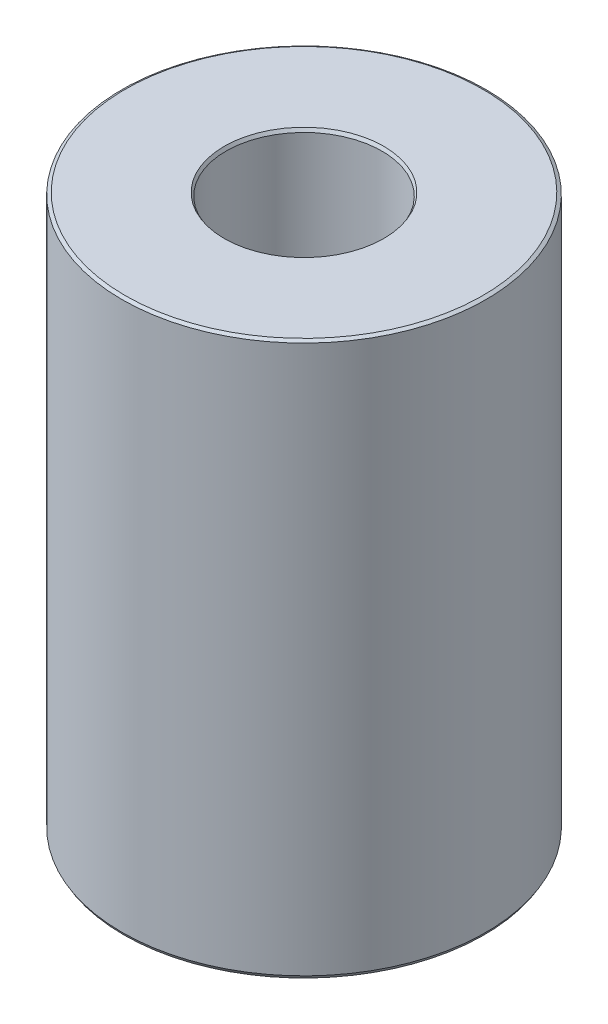
ISO-10303-21;
HEADER;
FILE_DESCRIPTION(('STEP AP214'),'2;1');
FILE_NAME('part.step','',(''),(''),'','','');
FILE_SCHEMA(('AUTOMOTIVE_DESIGN { 1 0 10303 214 1 1 1 1 }'));
ENDSEC;
DATA;
#1=APPLICATION_CONTEXT('core data for automotive mechanical design processes');
#2=APPLICATION_PROTOCOL_DEFINITION('international standard','automotive_design',2000,#1);
#3=PRODUCT_CONTEXT('',#1,'mechanical');
#4=PRODUCT('Part','Part','',(#3));
#5=PRODUCT_RELATED_PRODUCT_CATEGORY('part','',(#4));
#6=PRODUCT_DEFINITION_FORMATION('','',#4);
#7=PRODUCT_DEFINITION_CONTEXT('part definition',#1,'design');
#8=PRODUCT_DEFINITION('design','',#6,#7);
#9=PRODUCT_DEFINITION_SHAPE('','',#8);
#10=(LENGTH_UNIT() NAMED_UNIT(*) SI_UNIT(.MILLI.,.METRE.));
#11=(NAMED_UNIT(*) PLANE_ANGLE_UNIT() SI_UNIT($,.RADIAN.));
#12=(NAMED_UNIT(*) SI_UNIT($,.STERADIAN.) SOLID_ANGLE_UNIT());
#13=UNCERTAINTY_MEASURE_WITH_UNIT(LENGTH_MEASURE(1.E-05),#10,'distance_accuracy_value','');
#14=(GEOMETRIC_REPRESENTATION_CONTEXT(3) GLOBAL_UNCERTAINTY_ASSIGNED_CONTEXT((#13)) GLOBAL_UNIT_ASSIGNED_CONTEXT((#10,
#11,#12)) REPRESENTATION_CONTEXT('',''));
#15=CARTESIAN_POINT('',(0.,0.,0.));
#16=DIRECTION('',(0.,0.,1.));
#17=DIRECTION('',(1.,0.,0.));
#18=AXIS2_PLACEMENT_3D('',#15,#16,#17);
#19=CARTESIAN_POINT('',(0.,167.16306534625,0.));
#20=DIRECTION('',(0.,-1.,0.));
#21=DIRECTION('',(0.,0.,-1.));
#22=AXIS2_PLACEMENT_3D('',#19,#20,#21);
#23=CYLINDRICAL_SURFACE('',#22,55.);
#24=CARTESIAN_POINT('',(0.,0.965282264389078,0.));
#25=DIRECTION('',(0.,1.,0.));
#26=DIRECTION('',(0.,0.,1.));
#27=AXIS2_PLACEMENT_3D('',#24,#25,#26);
#28=CIRCLE('',#27,55.);
#29=CARTESIAN_POINT('',(0.,0.965282264389078,55.));
#30=VERTEX_POINT('',#29);
#31=EDGE_CURVE('E10',#30,#30,#28,.T.);
#32=ORIENTED_EDGE('',*,*,#31,.T.);
#33=EDGE_LOOP('',(#32));
#34=FACE_BOUND('',#33,.T.);
#35=CARTESIAN_POINT('',(0.,166.605759371061,0.));
#36=DIRECTION('',(0.,1.,0.));
#37=DIRECTION('',(0.,0.,1.));
#38=AXIS2_PLACEMENT_3D('',#35,#36,#37);
#39=CIRCLE('',#38,55.);
#40=CARTESIAN_POINT('',(0.,166.605759371061,55.));
#41=VERTEX_POINT('',#40);
#42=EDGE_CURVE('E50',#41,#41,#39,.F.);
#43=ORIENTED_EDGE('',*,*,#42,.T.);
#44=EDGE_LOOP('',(#43));
#45=FACE_BOUND('',#44,.T.);
#46=ADVANCED_FACE('F39',(#34,#45),#23,.T.);
#47=CARTESIAN_POINT('',(0.,167.16306534625,0.));
#48=DIRECTION('',(0.,1.,0.));
#49=DIRECTION('',(0.,0.,1.));
#50=AXIS2_PLACEMENT_3D('',#47,#48,#49);
#51=PLANE('',#50);
#52=CARTESIAN_POINT('',(0.,167.16306534625,0.));
#53=DIRECTION('',(0.,1.,0.));
#54=DIRECTION('',(0.,0.,1.));
#55=AXIS2_PLACEMENT_3D('',#52,#53,#54);
#56=CIRCLE('',#55,24.1350248384739);
#57=CARTESIAN_POINT('',(0.,167.16306534625,24.1350248384739));
#58=VERTEX_POINT('',#57);
#59=EDGE_CURVE('E58',#58,#58,#56,.F.);
#60=ORIENTED_EDGE('',*,*,#59,.T.);
#61=EDGE_LOOP('',(#60));
#62=FACE_BOUND('',#61,.T.);
#63=CARTESIAN_POINT('',(0.,167.16306534625,0.));
#64=DIRECTION('',(0.,1.,0.));
#65=DIRECTION('',(0.,0.,1.));
#66=AXIS2_PLACEMENT_3D('',#63,#64,#65);
#67=CIRCLE('',#66,54.0347177356108);
#68=CARTESIAN_POINT('',(0.,167.16306534625,54.0347177356108));
#69=VERTEX_POINT('',#68);
#70=EDGE_CURVE('E61',#69,#69,#67,.T.);
#71=ORIENTED_EDGE('',*,*,#70,.T.);
#72=EDGE_LOOP('',(#71));
#73=FACE_BOUND('',#72,.T.);
#74=ADVANCED_FACE('F88',(#62,#73),#51,.T.);
#75=CARTESIAN_POINT('',(0.,0.,0.));
#76=DIRECTION('',(0.,1.,0.));
#77=DIRECTION('',(0.,0.,1.));
#78=AXIS2_PLACEMENT_3D('',#75,#76,#77);
#79=PLANE('',#78);
#80=CARTESIAN_POINT('',(0.,0.,0.));
#81=DIRECTION('',(0.,1.,0.));
#82=DIRECTION('',(0.,0.,1.));
#83=AXIS2_PLACEMENT_3D('',#80,#81,#82);
#84=CIRCLE('',#83,24.543001127674);
#85=CARTESIAN_POINT('',(0.,0.,24.543001127674));
#86=VERTEX_POINT('',#85);
#87=EDGE_CURVE('E51',#86,#86,#84,.T.);
#88=ORIENTED_EDGE('',*,*,#87,.T.);
#89=EDGE_LOOP('',(#88));
#90=FACE_BOUND('',#89,.T.);
#91=CARTESIAN_POINT('',(0.,0.,0.));
#92=DIRECTION('',(0.,1.,0.));
#93=DIRECTION('',(0.,0.,1.));
#94=AXIS2_PLACEMENT_3D('',#91,#92,#93);
#95=CIRCLE('',#94,54.442694024811);
#96=CARTESIAN_POINT('',(0.,0.,54.442694024811));
#97=VERTEX_POINT('',#96);
#98=EDGE_CURVE('E54',#97,#97,#95,.F.);
#99=ORIENTED_EDGE('',*,*,#98,.T.);
#100=EDGE_LOOP('',(#99));
#101=FACE_BOUND('',#100,.T.);
#102=ADVANCED_FACE('F83',(#90,#101),#79,.F.);
#103=CARTESIAN_POINT('',(0.,167.16306534625,0.));
#104=DIRECTION('',(0.,-1.,0.));
#105=DIRECTION('',(0.,0.,-1.));
#106=AXIS2_PLACEMENT_3D('',#103,#104,#105);
#107=CYLINDRICAL_SURFACE('',#106,23.5777188632849);
#108=CARTESIAN_POINT('',(0.,166.197783081861,0.));
#109=DIRECTION('',(0.,1.,0.));
#110=DIRECTION('',(0.,0.,1.));
#111=AXIS2_PLACEMENT_3D('',#108,#109,#110);
#112=CIRCLE('',#111,23.5777188632849);
#113=CARTESIAN_POINT('',(0.,166.197783081861,23.5777188632849));
#114=VERTEX_POINT('',#113);
#115=EDGE_CURVE('E67',#114,#114,#112,.T.);
#116=ORIENTED_EDGE('',*,*,#115,.T.);
#117=EDGE_LOOP('',(#116));
#118=FACE_BOUND('',#117,.T.);
#119=CARTESIAN_POINT('',(0.,0.557305975189021,0.));
#120=DIRECTION('',(0.,1.,0.));
#121=DIRECTION('',(0.,0.,1.));
#122=AXIS2_PLACEMENT_3D('',#119,#120,#121);
#123=CIRCLE('',#122,23.5777188632849);
#124=CARTESIAN_POINT('',(0.,0.557305975189021,23.5777188632849));
#125=VERTEX_POINT('',#124);
#126=EDGE_CURVE('E69',#125,#125,#123,.F.);
#127=ORIENTED_EDGE('',*,*,#126,.T.);
#128=EDGE_LOOP('',(#127));
#129=FACE_BOUND('',#128,.T.);
#130=ADVANCED_FACE('F71',(#118,#129),#107,.F.);
#131=CARTESIAN_POINT('',(0.,166.197783081861,0.));
#132=DIRECTION('',(0.,1.,0.));
#133=DIRECTION('',(0.,0.,1.));
#134=AXIS2_PLACEMENT_3D('',#131,#132,#133);
#135=CONICAL_SURFACE('',#134,23.5777188632849,0.523598775598291);
#136=ORIENTED_EDGE('',*,*,#59,.F.);
#137=EDGE_LOOP('',(#136));
#138=FACE_BOUND('',#137,.T.);
#139=ORIENTED_EDGE('',*,*,#115,.F.);
#140=EDGE_LOOP('',(#139));
#141=FACE_BOUND('',#140,.T.);
#142=ADVANCED_FACE('F77',(#138,#141),#135,.F.);
#143=CARTESIAN_POINT('',(0.,0.,0.));
#144=DIRECTION('',(0.,-1.,0.));
#145=DIRECTION('',(0.,0.,-1.));
#146=AXIS2_PLACEMENT_3D('',#143,#144,#145);
#147=CONICAL_SURFACE('',#146,24.543001127674,1.04719755119659);
#148=ORIENTED_EDGE('',*,*,#126,.F.);
#149=EDGE_LOOP('',(#148));
#150=FACE_BOUND('',#149,.T.);
#151=ORIENTED_EDGE('',*,*,#87,.F.);
#152=EDGE_LOOP('',(#151));
#153=FACE_BOUND('',#152,.T.);
#154=ADVANCED_FACE('F73',(#150,#153),#147,.F.);
#155=CARTESIAN_POINT('',(0.,0.965282264389078,0.));
#156=DIRECTION('',(0.,1.,0.));
#157=DIRECTION('',(0.,0.,1.));
#158=AXIS2_PLACEMENT_3D('',#155,#156,#157);
#159=CONICAL_SURFACE('',#158,55.,0.5235987755983);
#160=ORIENTED_EDGE('',*,*,#98,.F.);
#161=EDGE_LOOP('',(#160));
#162=FACE_BOUND('',#161,.T.);
#163=ORIENTED_EDGE('',*,*,#31,.F.);
#164=EDGE_LOOP('',(#163));
#165=FACE_BOUND('',#164,.T.);
#166=ADVANCED_FACE('F76',(#162,#165),#159,.T.);
#167=CARTESIAN_POINT('',(0.,167.16306534625,0.));
#168=DIRECTION('',(0.,-1.,0.));
#169=DIRECTION('',(0.,0.,-1.));
#170=AXIS2_PLACEMENT_3D('',#167,#168,#169);
#171=CONICAL_SURFACE('',#170,54.0347177356108,1.04719755119659);
#172=ORIENTED_EDGE('',*,*,#42,.F.);
#173=EDGE_LOOP('',(#172));
#174=FACE_BOUND('',#173,.T.);
#175=ORIENTED_EDGE('',*,*,#70,.F.);
#176=EDGE_LOOP('',(#175));
#177=FACE_BOUND('',#176,.T.);
#178=ADVANCED_FACE('F45',(#174,#177),#171,.T.);
#179=CLOSED_SHELL('',(#46,#74,#102,#130,#142,#154,#166,#178));
#180=MANIFOLD_SOLID_BREP('B2',#179);
#181=ADVANCED_BREP_SHAPE_REPRESENTATION('',(#18,#180),#14);
#182=SHAPE_DEFINITION_REPRESENTATION(#9,#181);
ENDSEC;
END-ISO-10303-21;
